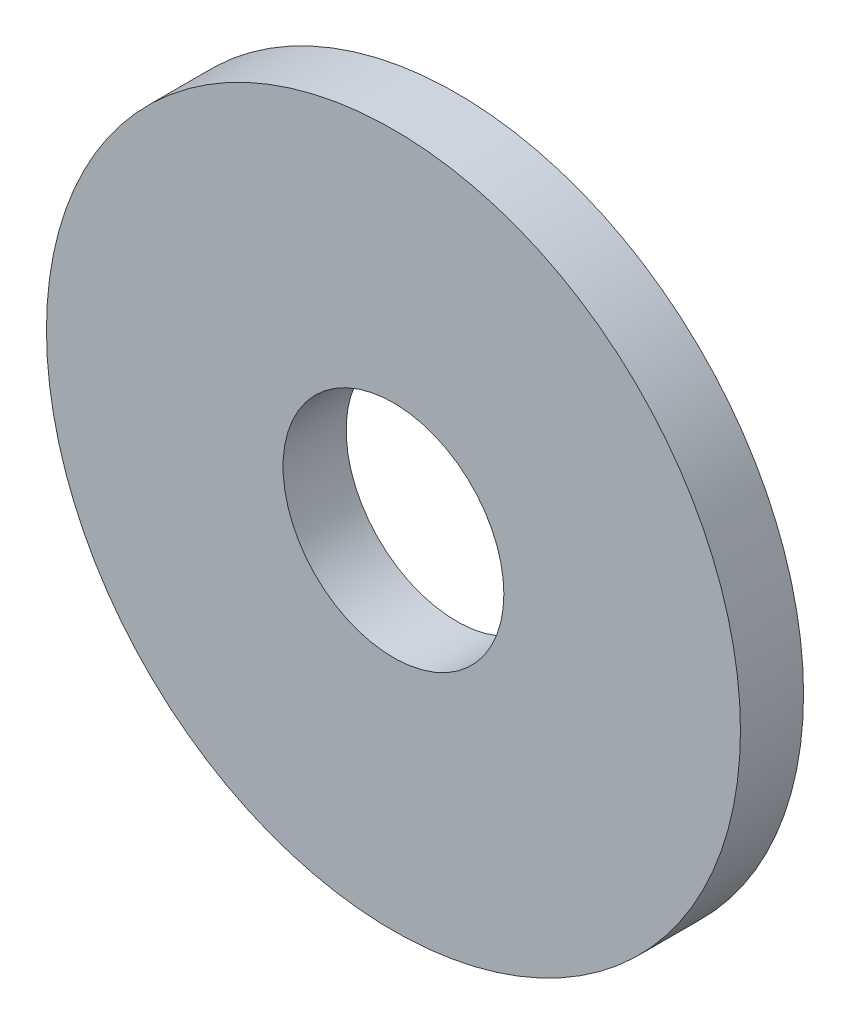
ISO-10303-21;
HEADER;
FILE_DESCRIPTION(('STEP AP214'),'2;1');
FILE_NAME('part.step','',(''),(''),'','','');
FILE_SCHEMA(('AUTOMOTIVE_DESIGN { 1 0 10303 214 1 1 1 1 }'));
ENDSEC;
DATA;
#1=APPLICATION_CONTEXT('core data for automotive mechanical design processes');
#2=APPLICATION_PROTOCOL_DEFINITION('international standard','automotive_design',2000,#1);
#3=PRODUCT_CONTEXT('',#1,'mechanical');
#4=PRODUCT('Part','Part','',(#3));
#5=PRODUCT_RELATED_PRODUCT_CATEGORY('part','',(#4));
#6=PRODUCT_DEFINITION_FORMATION('','',#4);
#7=PRODUCT_DEFINITION_CONTEXT('part definition',#1,'design');
#8=PRODUCT_DEFINITION('design','',#6,#7);
#9=PRODUCT_DEFINITION_SHAPE('','',#8);
#10=(LENGTH_UNIT() NAMED_UNIT(*) SI_UNIT(.MILLI.,.METRE.));
#11=(NAMED_UNIT(*) PLANE_ANGLE_UNIT() SI_UNIT($,.RADIAN.));
#12=(NAMED_UNIT(*) SI_UNIT($,.STERADIAN.) SOLID_ANGLE_UNIT());
#13=UNCERTAINTY_MEASURE_WITH_UNIT(LENGTH_MEASURE(1.E-05),#10,'distance_accuracy_value','');
#14=(GEOMETRIC_REPRESENTATION_CONTEXT(3) GLOBAL_UNCERTAINTY_ASSIGNED_CONTEXT((#13)) GLOBAL_UNIT_ASSIGNED_CONTEXT((#10,
#11,#12)) REPRESENTATION_CONTEXT('',''));
#15=CARTESIAN_POINT('',(0.,0.,0.));
#16=DIRECTION('',(0.,0.,1.));
#17=DIRECTION('',(1.,0.,0.));
#18=AXIS2_PLACEMENT_3D('',#15,#16,#17);
#19=CARTESIAN_POINT('',(0.,0.,3.));
#20=DIRECTION('',(0.,0.,1.));
#21=DIRECTION('',(1.,0.,0.));
#22=AXIS2_PLACEMENT_3D('',#19,#20,#21);
#23=PLANE('',#22);
#24=CARTESIAN_POINT('',(0.,0.,3.));
#25=DIRECTION('',(0.,0.,1.));
#26=DIRECTION('',(1.,0.,0.));
#27=AXIS2_PLACEMENT_3D('',#24,#25,#26);
#28=CIRCLE('',#27,16.500000000001);
#29=CARTESIAN_POINT('',(16.500000000001,0.,3.));
#30=VERTEX_POINT('',#29);
#31=EDGE_CURVE('E10',#30,#30,#28,.T.);
#32=ORIENTED_EDGE('',*,*,#31,.T.);
#33=EDGE_LOOP('',(#32));
#34=FACE_BOUND('',#33,.T.);
#35=CARTESIAN_POINT('',(0.,0.,3.));
#36=DIRECTION('',(0.,0.,1.));
#37=DIRECTION('',(1.,0.,0.));
#38=AXIS2_PLACEMENT_3D('',#35,#36,#37);
#39=CIRCLE('',#38,5.25);
#40=CARTESIAN_POINT('',(5.25,0.,3.));
#41=VERTEX_POINT('',#40);
#42=EDGE_CURVE('E45',#41,#41,#39,.T.);
#43=ORIENTED_EDGE('',*,*,#42,.F.);
#44=EDGE_LOOP('',(#43));
#45=FACE_BOUND('',#44,.T.);
#46=ADVANCED_FACE('F34',(#34,#45),#23,.T.);
#47=CARTESIAN_POINT('',(0.,0.,0.));
#48=DIRECTION('',(0.,0.,1.));
#49=DIRECTION('',(1.,0.,0.));
#50=AXIS2_PLACEMENT_3D('',#47,#48,#49);
#51=PLANE('',#50);
#52=CARTESIAN_POINT('',(0.,0.,0.));
#53=DIRECTION('',(0.,0.,1.));
#54=DIRECTION('',(1.,0.,0.));
#55=AXIS2_PLACEMENT_3D('',#52,#53,#54);
#56=CIRCLE('',#55,16.500000000001);
#57=CARTESIAN_POINT('',(16.500000000001,0.,0.));
#58=VERTEX_POINT('',#57);
#59=EDGE_CURVE('E38',#58,#58,#56,.T.);
#60=ORIENTED_EDGE('',*,*,#59,.F.);
#61=EDGE_LOOP('',(#60));
#62=FACE_BOUND('',#61,.T.);
#63=CARTESIAN_POINT('',(0.,0.,0.));
#64=DIRECTION('',(0.,0.,1.));
#65=DIRECTION('',(1.,0.,0.));
#66=AXIS2_PLACEMENT_3D('',#63,#64,#65);
#67=CIRCLE('',#66,5.25);
#68=CARTESIAN_POINT('',(5.25,0.,0.));
#69=VERTEX_POINT('',#68);
#70=EDGE_CURVE('E47',#69,#69,#67,.T.);
#71=ORIENTED_EDGE('',*,*,#70,.T.);
#72=EDGE_LOOP('',(#71));
#73=FACE_BOUND('',#72,.T.);
#74=ADVANCED_FACE('F57',(#62,#73),#51,.F.);
#75=CARTESIAN_POINT('',(0.,0.,3.));
#76=DIRECTION('',(0.,0.,-1.));
#77=DIRECTION('',(-1.,0.,0.));
#78=AXIS2_PLACEMENT_3D('',#75,#76,#77);
#79=CYLINDRICAL_SURFACE('',#78,16.500000000001);
#80=ORIENTED_EDGE('',*,*,#31,.F.);
#81=EDGE_LOOP('',(#80));
#82=FACE_BOUND('',#81,.T.);
#83=ORIENTED_EDGE('',*,*,#59,.T.);
#84=EDGE_LOOP('',(#83));
#85=FACE_BOUND('',#84,.T.);
#86=ADVANCED_FACE('F36',(#82,#85),#79,.T.);
#87=CARTESIAN_POINT('',(0.,0.,3.));
#88=DIRECTION('',(0.,0.,-1.));
#89=DIRECTION('',(-1.,0.,0.));
#90=AXIS2_PLACEMENT_3D('',#87,#88,#89);
#91=CYLINDRICAL_SURFACE('',#90,5.25);
#92=ORIENTED_EDGE('',*,*,#42,.T.);
#93=EDGE_LOOP('',(#92));
#94=FACE_BOUND('',#93,.T.);
#95=ORIENTED_EDGE('',*,*,#70,.F.);
#96=EDGE_LOOP('',(#95));
#97=FACE_BOUND('',#96,.T.);
#98=ADVANCED_FACE('F53',(#94,#97),#91,.F.);
#99=CLOSED_SHELL('',(#46,#74,#86,#98));
#100=MANIFOLD_SOLID_BREP('B2',#99);
#101=ADVANCED_BREP_SHAPE_REPRESENTATION('',(#18,#100),#14);
#102=SHAPE_DEFINITION_REPRESENTATION(#9,#101);
ENDSEC;
END-ISO-10303-21;
